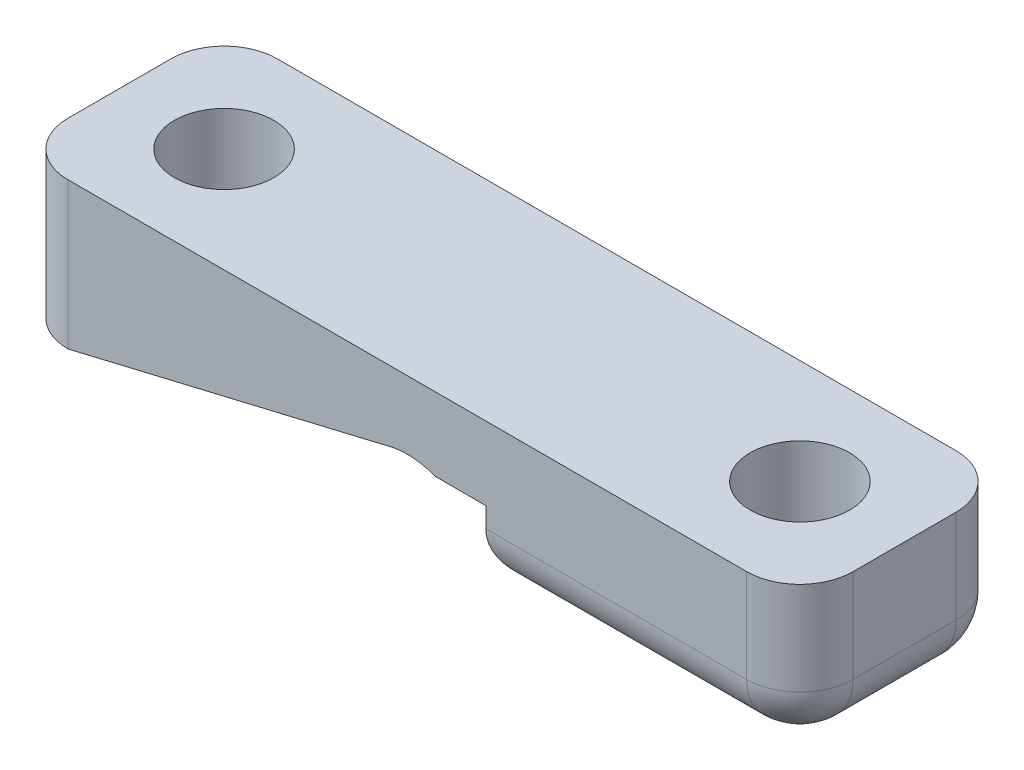
ISO-10303-21;
HEADER;
FILE_DESCRIPTION(('STEP AP214'),'2;1');
FILE_NAME('part.step','',(''),(''),'','','');
FILE_SCHEMA(('AUTOMOTIVE_DESIGN { 1 0 10303 214 1 1 1 1 }'));
ENDSEC;
DATA;
#1=APPLICATION_CONTEXT('core data for automotive mechanical design processes');
#2=APPLICATION_PROTOCOL_DEFINITION('international standard','automotive_design',2000,#1);
#3=PRODUCT_CONTEXT('',#1,'mechanical');
#4=PRODUCT('Part','Part','',(#3));
#5=PRODUCT_RELATED_PRODUCT_CATEGORY('part','',(#4));
#6=PRODUCT_DEFINITION_FORMATION('','',#4);
#7=PRODUCT_DEFINITION_CONTEXT('part definition',#1,'design');
#8=PRODUCT_DEFINITION('design','',#6,#7);
#9=PRODUCT_DEFINITION_SHAPE('','',#8);
#10=(LENGTH_UNIT() NAMED_UNIT(*) SI_UNIT(.MILLI.,.METRE.));
#11=(NAMED_UNIT(*) PLANE_ANGLE_UNIT() SI_UNIT($,.RADIAN.));
#12=(NAMED_UNIT(*) SI_UNIT($,.STERADIAN.) SOLID_ANGLE_UNIT());
#13=UNCERTAINTY_MEASURE_WITH_UNIT(LENGTH_MEASURE(1.E-05),#10,'distance_accuracy_value','');
#14=(GEOMETRIC_REPRESENTATION_CONTEXT(3) GLOBAL_UNCERTAINTY_ASSIGNED_CONTEXT((#13)) GLOBAL_UNIT_ASSIGNED_CONTEXT((#10,
#11,#12)) REPRESENTATION_CONTEXT('',''));
#15=CARTESIAN_POINT('',(0.,0.,0.));
#16=DIRECTION('',(0.,0.,1.));
#17=DIRECTION('',(1.,0.,0.));
#18=AXIS2_PLACEMENT_3D('',#15,#16,#17);
#19=CARTESIAN_POINT('',(0.,0.,10.));
#20=DIRECTION('',(0.,1.,0.));
#21=DIRECTION('',(0.,0.,1.));
#22=AXIS2_PLACEMENT_3D('',#19,#20,#21);
#23=PLANE('',#22);
#24=DIRECTION('',(0.,0.,-1.));
#25=VECTOR('',#24,1.);
#26=CARTESIAN_POINT('',(34.96,0.,10.));
#27=LINE('',#26,#25);
#28=CARTESIAN_POINT('',(34.96,0.,2.54));
#29=VERTEX_POINT('',#28);
#30=CARTESIAN_POINT('',(34.96,0.,7.46));
#31=VERTEX_POINT('',#30);
#32=EDGE_CURVE('E300',#29,#31,#27,.F.);
#33=ORIENTED_EDGE('',*,*,#32,.T.);
#34=DIRECTION('',(1.,0.,0.));
#35=VECTOR('',#34,1.);
#36=CARTESIAN_POINT('',(0.,0.,7.46));
#37=LINE('',#36,#35);
#38=CARTESIAN_POINT('',(24.9584866892291,0.,7.46));
#39=VERTEX_POINT('',#38);
#40=EDGE_CURVE('E303',#31,#39,#37,.F.);
#41=ORIENTED_EDGE('',*,*,#40,.T.);
#42=CARTESIAN_POINT('',(30.7341258248556,0.,8.39004140497769));
#43=DIRECTION('',(0.,1.,0.));
#44=DIRECTION('',(0.,0.,1.));
#45=AXIS2_PLACEMENT_3D('',#42,#43,#44);
#46=CIRCLE('',#45,5.85004140497769);
#47=CARTESIAN_POINT('',(30.7341258248556,0.,2.54));
#48=VERTEX_POINT('',#47);
#49=EDGE_CURVE('E294',#39,#48,#46,.F.);
#50=ORIENTED_EDGE('',*,*,#49,.T.);
#51=DIRECTION('',(1.,0.,0.));
#52=VECTOR('',#51,1.);
#53=CARTESIAN_POINT('',(34.96,0.,2.54));
#54=LINE('',#53,#52);
#55=EDGE_CURVE('E297',#48,#29,#54,.T.);
#56=ORIENTED_EDGE('',*,*,#55,.T.);
#57=EDGE_LOOP('',(#33,#41,#50,#56));
#58=FACE_BOUND('',#57,.T.);
#59=CARTESIAN_POINT('',(32.5,0.,5.));
#60=DIRECTION('',(0.,1.,0.));
#61=DIRECTION('',(0.,0.,1.));
#62=AXIS2_PLACEMENT_3D('',#59,#60,#61);
#63=CIRCLE('',#62,2.375);
#64=CARTESIAN_POINT('',(32.5,0.,7.375));
#65=VERTEX_POINT('',#64);
#66=EDGE_CURVE('E206',#65,#65,#63,.T.);
#67=ORIENTED_EDGE('',*,*,#66,.T.);
#68=EDGE_LOOP('',(#67));
#69=FACE_BOUND('',#68,.T.);
#70=ADVANCED_FACE('F41',(#58,#69),#23,.F.);
#71=CARTESIAN_POINT('',(0.,0.,10.));
#72=DIRECTION('',(0.,0.,-1.));
#73=DIRECTION('',(-1.,0.,0.));
#74=AXIS2_PLACEMENT_3D('',#71,#72,#73);
#75=PLANE('',#74);
#76=DIRECTION('',(0.,-1.,0.));
#77=VECTOR('',#76,1.);
#78=CARTESIAN_POINT('',(22.5,3.5,10.));
#79=LINE('',#78,#77);
#80=CARTESIAN_POINT('',(22.5,3.5,10.));
#81=VERTEX_POINT('',#80);
#82=CARTESIAN_POINT('',(22.5,2.54,10.));
#83=VERTEX_POINT('',#82);
#84=EDGE_CURVE('E146',#81,#83,#79,.T.);
#85=ORIENTED_EDGE('',*,*,#84,.T.);
#86=DIRECTION('',(1.,0.,0.));
#87=VECTOR('',#86,1.);
#88=CARTESIAN_POINT('',(0.,2.54,10.));
#89=LINE('',#88,#87);
#90=CARTESIAN_POINT('',(34.96,2.54,10.));
#91=VERTEX_POINT('',#90);
#92=EDGE_CURVE('E291',#83,#91,#89,.T.);
#93=ORIENTED_EDGE('',*,*,#92,.T.);
#94=DIRECTION('',(0.,1.,0.));
#95=VECTOR('',#94,1.);
#96=CARTESIAN_POINT('',(34.96,0.,10.));
#97=LINE('',#96,#95);
#98=CARTESIAN_POINT('',(34.96,7.,10.));
#99=VERTEX_POINT('',#98);
#100=EDGE_CURVE('E273',#91,#99,#97,.T.);
#101=ORIENTED_EDGE('',*,*,#100,.T.);
#102=DIRECTION('',(-1.,0.,0.));
#103=VECTOR('',#102,1.);
#104=CARTESIAN_POINT('',(0.,7.,10.));
#105=LINE('',#104,#103);
#106=CARTESIAN_POINT('',(2.54,7.,10.));
#107=VERTEX_POINT('',#106);
#108=EDGE_CURVE('E216',#99,#107,#105,.T.);
#109=ORIENTED_EDGE('',*,*,#108,.T.);
#110=DIRECTION('',(0.,-1.,0.));
#111=VECTOR('',#110,1.);
#112=CARTESIAN_POINT('',(2.54,0.,10.));
#113=LINE('',#112,#111);
#114=CARTESIAN_POINT('',(2.54,0.,10.));
#115=VERTEX_POINT('',#114);
#116=EDGE_CURVE('E269',#107,#115,#113,.T.);
#117=ORIENTED_EDGE('',*,*,#116,.T.);
#118=DIRECTION('',(0.972969168958049,0.230935047701912,0.));
#119=VECTOR('',#118,1.);
#120=CARTESIAN_POINT('',(2.54,0.,10.));
#121=LINE('',#120,#119);
#122=CARTESIAN_POINT('',(17.6700654329473,3.59113371108409,10.));
#123=VERTEX_POINT('',#122);
#124=EDGE_CURVE('E178',#115,#123,#121,.T.);
#125=ORIENTED_EDGE('',*,*,#124,.T.);
#126=CARTESIAN_POINT('',(18.75,0.,10.));
#127=DIRECTION('',(0.,0.,-1.));
#128=DIRECTION('',(-1.,0.,0.));
#129=AXIS2_PLACEMENT_3D('',#126,#127,#128);
#130=CIRCLE('',#129,3.75);
#131=CARTESIAN_POINT('',(20.0962912017836,3.5,10.));
#132=VERTEX_POINT('',#131);
#133=EDGE_CURVE('E170',#123,#132,#130,.T.);
#134=ORIENTED_EDGE('',*,*,#133,.T.);
#135=DIRECTION('',(-1.,0.,0.));
#136=VECTOR('',#135,1.);
#137=CARTESIAN_POINT('',(0.,3.5,10.));
#138=LINE('',#137,#136);
#139=EDGE_CURVE('E161',#81,#132,#138,.T.);
#140=ORIENTED_EDGE('',*,*,#139,.F.);
#141=EDGE_LOOP('',(#85,#93,#101,#109,#117,#125,#134,#140));
#142=FACE_BOUND('',#141,.T.);
#143=ADVANCED_FACE('F167',(#142),#75,.F.);
#144=CARTESIAN_POINT('',(18.75,0.,0.));
#145=DIRECTION('',(0.,0.,1.));
#146=DIRECTION('',(1.,0.,0.));
#147=AXIS2_PLACEMENT_3D('',#144,#145,#146);
#148=CYLINDRICAL_SURFACE('',#147,3.75);
#149=DIRECTION('',(0.,0.,1.));
#150=VECTOR('',#149,1.);
#151=CARTESIAN_POINT('',(20.0962912017836,3.5,0.));
#152=LINE('',#151,#150);
#153=CARTESIAN_POINT('',(20.0962912017836,3.5,0.));
#154=VERTEX_POINT('',#153);
#155=EDGE_CURVE('E276',#132,#154,#152,.F.);
#156=ORIENTED_EDGE('',*,*,#155,.F.);
#157=ORIENTED_EDGE('',*,*,#133,.F.);
#158=DIRECTION('',(0.,0.,1.));
#159=VECTOR('',#158,1.);
#160=CARTESIAN_POINT('',(17.6700654329473,3.59113371108409,0.));
#161=LINE('',#160,#159);
#162=CARTESIAN_POINT('',(17.6700654329473,3.59113371108409,0.));
#163=VERTEX_POINT('',#162);
#164=EDGE_CURVE('E188',#123,#163,#161,.F.);
#165=ORIENTED_EDGE('',*,*,#164,.T.);
#166=CARTESIAN_POINT('',(18.75,0.,0.));
#167=DIRECTION('',(0.,0.,1.));
#168=DIRECTION('',(1.,0.,0.));
#169=AXIS2_PLACEMENT_3D('',#166,#167,#168);
#170=CIRCLE('',#169,3.75);
#171=EDGE_CURVE('E210',#154,#163,#170,.T.);
#172=ORIENTED_EDGE('',*,*,#171,.F.);
#173=EDGE_LOOP('',(#156,#157,#165,#172));
#174=FACE_BOUND('',#173,.T.);
#175=ADVANCED_FACE('F361',(#174),#148,.F.);
#176=CARTESIAN_POINT('',(2.54,0.,2.54));
#177=DIRECTION('',(0.,1.,0.));
#178=DIRECTION('',(0.,0.,1.));
#179=AXIS2_PLACEMENT_3D('',#176,#177,#178);
#180=CIRCLE('',#179,2.54);
#181=CARTESIAN_POINT('',(0.,0.,2.54));
#182=VERTEX_POINT('',#181);
#183=CARTESIAN_POINT('',(2.54,0.,0.));
#184=VERTEX_POINT('',#183);
#185=EDGE_CURVE('E245',#182,#184,#180,.F.);
#186=ORIENTED_EDGE('',*,*,#185,.T.);
#187=DIRECTION('',(0.,0.,-1.));
#188=VECTOR('',#187,1.);
#189=CARTESIAN_POINT('',(2.54,0.,10.));
#190=LINE('',#189,#188);
#191=EDGE_CURVE('E182',#115,#184,#190,.T.);
#192=ORIENTED_EDGE('',*,*,#191,.F.);
#193=CARTESIAN_POINT('',(2.54,0.,7.46));
#194=DIRECTION('',(0.,1.,0.));
#195=DIRECTION('',(0.,0.,1.));
#196=AXIS2_PLACEMENT_3D('',#193,#194,#195);
#197=CIRCLE('',#196,2.54);
#198=CARTESIAN_POINT('',(0.,0.,7.46));
#199=VERTEX_POINT('',#198);
#200=EDGE_CURVE('E242',#115,#199,#197,.F.);
#201=ORIENTED_EDGE('',*,*,#200,.T.);
#202=DIRECTION('',(0.,0.,-1.));
#203=VECTOR('',#202,1.);
#204=CARTESIAN_POINT('',(0.,0.,10.));
#205=LINE('',#204,#203);
#206=EDGE_CURVE('E231',#199,#182,#205,.T.);
#207=ORIENTED_EDGE('',*,*,#206,.T.);
#208=EDGE_LOOP('',(#186,#192,#201,#207));
#209=FACE_BOUND('',#208,.T.);
#210=ADVANCED_FACE('F357',(#209),#23,.F.);
#211=CARTESIAN_POINT('',(0.,0.,10.));
#212=DIRECTION('',(1.,0.,0.));
#213=DIRECTION('',(0.,0.,-1.));
#214=AXIS2_PLACEMENT_3D('',#211,#212,#213);
#215=PLANE('',#214);
#216=DIRECTION('',(0.,0.,-1.));
#217=VECTOR('',#216,1.);
#218=CARTESIAN_POINT('',(0.,7.,10.));
#219=LINE('',#218,#217);
#220=CARTESIAN_POINT('',(0.,7.,7.46));
#221=VERTEX_POINT('',#220);
#222=CARTESIAN_POINT('',(0.,7.,2.54));
#223=VERTEX_POINT('',#222);
#224=EDGE_CURVE('E220',#221,#223,#219,.T.);
#225=ORIENTED_EDGE('',*,*,#224,.T.);
#226=DIRECTION('',(0.,-1.,0.));
#227=VECTOR('',#226,1.);
#228=CARTESIAN_POINT('',(0.,0.,2.54));
#229=LINE('',#228,#227);
#230=EDGE_CURVE('E238',#223,#182,#229,.T.);
#231=ORIENTED_EDGE('',*,*,#230,.T.);
#232=ORIENTED_EDGE('',*,*,#206,.F.);
#233=DIRECTION('',(0.,-1.,0.));
#234=VECTOR('',#233,1.);
#235=CARTESIAN_POINT('',(0.,0.,7.46));
#236=LINE('',#235,#234);
#237=EDGE_CURVE('E235',#199,#221,#236,.F.);
#238=ORIENTED_EDGE('',*,*,#237,.T.);
#239=EDGE_LOOP('',(#225,#231,#232,#238));
#240=FACE_BOUND('',#239,.T.);
#241=ADVANCED_FACE('F367',(#240),#215,.F.);
#242=CARTESIAN_POINT('',(37.5,0.,10.));
#243=DIRECTION('',(-1.,0.,0.));
#244=DIRECTION('',(0.,0.,1.));
#245=AXIS2_PLACEMENT_3D('',#242,#243,#244);
#246=PLANE('',#245);
#247=DIRECTION('',(0.,1.,0.));
#248=VECTOR('',#247,1.);
#249=CARTESIAN_POINT('',(37.5,0.,7.46));
#250=LINE('',#249,#248);
#251=CARTESIAN_POINT('',(37.5,7.,7.46));
#252=VERTEX_POINT('',#251);
#253=CARTESIAN_POINT('',(37.5,2.54,7.46));
#254=VERTEX_POINT('',#253);
#255=EDGE_CURVE('E262',#252,#254,#250,.F.);
#256=ORIENTED_EDGE('',*,*,#255,.T.);
#257=DIRECTION('',(0.,0.,-1.));
#258=VECTOR('',#257,1.);
#259=CARTESIAN_POINT('',(37.5,2.54,10.));
#260=LINE('',#259,#258);
#261=CARTESIAN_POINT('',(37.5,2.54,2.54));
#262=VERTEX_POINT('',#261);
#263=EDGE_CURVE('E310',#254,#262,#260,.T.);
#264=ORIENTED_EDGE('',*,*,#263,.T.);
#265=DIRECTION('',(0.,1.,0.));
#266=VECTOR('',#265,1.);
#267=CARTESIAN_POINT('',(37.5,7.,2.54));
#268=LINE('',#267,#266);
#269=CARTESIAN_POINT('',(37.5,7.,2.54));
#270=VERTEX_POINT('',#269);
#271=EDGE_CURVE('E266',#262,#270,#268,.T.);
#272=ORIENTED_EDGE('',*,*,#271,.T.);
#273=DIRECTION('',(0.,0.,-1.));
#274=VECTOR('',#273,1.);
#275=CARTESIAN_POINT('',(37.5,7.,10.));
#276=LINE('',#275,#274);
#277=EDGE_CURVE('E227',#252,#270,#276,.T.);
#278=ORIENTED_EDGE('',*,*,#277,.F.);
#279=EDGE_LOOP('',(#256,#264,#272,#278));
#280=FACE_BOUND('',#279,.T.);
#281=ADVANCED_FACE('F373',(#280),#246,.F.);
#282=CARTESIAN_POINT('',(0.,7.,10.));
#283=DIRECTION('',(0.,-1.,0.));
#284=DIRECTION('',(0.,0.,-1.));
#285=AXIS2_PLACEMENT_3D('',#282,#283,#284);
#286=PLANE('',#285);
#287=CARTESIAN_POINT('',(5.,7.,5.));
#288=DIRECTION('',(0.,1.,0.));
#289=DIRECTION('',(0.,0.,1.));
#290=AXIS2_PLACEMENT_3D('',#287,#288,#289);
#291=CIRCLE('',#290,2.375);
#292=CARTESIAN_POINT('',(5.,7.,7.375));
#293=VERTEX_POINT('',#292);
#294=EDGE_CURVE('E196',#293,#293,#291,.T.);
#295=ORIENTED_EDGE('',*,*,#294,.F.);
#296=EDGE_LOOP('',(#295));
#297=FACE_BOUND('',#296,.T.);
#298=CARTESIAN_POINT('',(32.5,7.,5.));
#299=DIRECTION('',(0.,1.,0.));
#300=DIRECTION('',(0.,0.,1.));
#301=AXIS2_PLACEMENT_3D('',#298,#299,#300);
#302=CIRCLE('',#301,2.375);
#303=CARTESIAN_POINT('',(32.5,7.,7.375));
#304=VERTEX_POINT('',#303);
#305=EDGE_CURVE('E202',#304,#304,#302,.T.);
#306=ORIENTED_EDGE('',*,*,#305,.F.);
#307=EDGE_LOOP('',(#306));
#308=FACE_BOUND('',#307,.T.);
#309=DIRECTION('',(-1.,0.,0.));
#310=VECTOR('',#309,1.);
#311=CARTESIAN_POINT('',(0.,7.,0.));
#312=LINE('',#311,#310);
#313=CARTESIAN_POINT('',(34.96,7.,0.));
#314=VERTEX_POINT('',#313);
#315=CARTESIAN_POINT('',(2.54,7.,0.));
#316=VERTEX_POINT('',#315);
#317=EDGE_CURVE('E215',#314,#316,#312,.T.);
#318=ORIENTED_EDGE('',*,*,#317,.T.);
#319=CARTESIAN_POINT('',(2.54,7.,2.54));
#320=DIRECTION('',(0.,-1.,0.));
#321=DIRECTION('',(0.,0.,-1.));
#322=AXIS2_PLACEMENT_3D('',#319,#320,#321);
#323=CIRCLE('',#322,2.54);
#324=EDGE_CURVE('E259',#316,#223,#323,.F.);
#325=ORIENTED_EDGE('',*,*,#324,.T.);
#326=ORIENTED_EDGE('',*,*,#224,.F.);
#327=CARTESIAN_POINT('',(2.54,7.,7.46));
#328=DIRECTION('',(0.,-1.,0.));
#329=DIRECTION('',(0.,0.,-1.));
#330=AXIS2_PLACEMENT_3D('',#327,#328,#329);
#331=CIRCLE('',#330,2.54);
#332=EDGE_CURVE('E250',#221,#107,#331,.F.);
#333=ORIENTED_EDGE('',*,*,#332,.T.);
#334=ORIENTED_EDGE('',*,*,#108,.F.);
#335=CARTESIAN_POINT('',(34.96,7.,7.46));
#336=DIRECTION('',(0.,-1.,0.));
#337=DIRECTION('',(0.,0.,-1.));
#338=AXIS2_PLACEMENT_3D('',#335,#336,#337);
#339=CIRCLE('',#338,2.54);
#340=EDGE_CURVE('E253',#99,#252,#339,.F.);
#341=ORIENTED_EDGE('',*,*,#340,.T.);
#342=ORIENTED_EDGE('',*,*,#277,.T.);
#343=CARTESIAN_POINT('',(34.96,7.,2.54));
#344=DIRECTION('',(0.,-1.,0.));
#345=DIRECTION('',(0.,0.,-1.));
#346=AXIS2_PLACEMENT_3D('',#343,#344,#345);
#347=CIRCLE('',#346,2.54);
#348=EDGE_CURVE('E256',#270,#314,#347,.F.);
#349=ORIENTED_EDGE('',*,*,#348,.T.);
#350=EDGE_LOOP('',(#318,#325,#326,#333,#334,#341,#342,#349));
#351=FACE_BOUND('',#350,.T.);
#352=ADVANCED_FACE('F389',(#297,#308,#351),#286,.F.);
#353=CARTESIAN_POINT('',(0.,0.,0.));
#354=DIRECTION('',(0.,0.,-1.));
#355=DIRECTION('',(-1.,0.,0.));
#356=AXIS2_PLACEMENT_3D('',#353,#354,#355);
#357=PLANE('',#356);
#358=DIRECTION('',(0.,1.,0.));
#359=VECTOR('',#358,1.);
#360=CARTESIAN_POINT('',(34.96,0.,0.));
#361=LINE('',#360,#359);
#362=CARTESIAN_POINT('',(34.96,2.54,0.));
#363=VERTEX_POINT('',#362);
#364=EDGE_CURVE('E246',#314,#363,#361,.F.);
#365=ORIENTED_EDGE('',*,*,#364,.T.);
#366=DIRECTION('',(1.,0.,0.));
#367=VECTOR('',#366,1.);
#368=CARTESIAN_POINT('',(30.7341258248556,2.54,0.));
#369=LINE('',#368,#367);
#370=CARTESIAN_POINT('',(30.7341258248556,2.54,0.));
#371=VERTEX_POINT('',#370);
#372=EDGE_CURVE('E51',#363,#371,#369,.F.);
#373=ORIENTED_EDGE('',*,*,#372,.T.);
#374=DIRECTION('',(0.,-1.,0.));
#375=VECTOR('',#374,1.);
#376=CARTESIAN_POINT('',(30.7341258248556,3.5,0.));
#377=LINE('',#376,#375);
#378=CARTESIAN_POINT('',(30.7341258248556,3.5,0.));
#379=VERTEX_POINT('',#378);
#380=EDGE_CURVE('E156',#379,#371,#377,.T.);
#381=ORIENTED_EDGE('',*,*,#380,.F.);
#382=DIRECTION('',(1.,0.,0.));
#383=VECTOR('',#382,1.);
#384=CARTESIAN_POINT('',(0.,3.5,0.));
#385=LINE('',#384,#383);
#386=EDGE_CURVE('E157',#154,#379,#385,.T.);
#387=ORIENTED_EDGE('',*,*,#386,.F.);
#388=ORIENTED_EDGE('',*,*,#171,.T.);
#389=DIRECTION('',(0.972969168958049,0.230935047701912,0.));
#390=VECTOR('',#389,1.);
#391=CARTESIAN_POINT('',(0.135460730492994,-0.570719410872374,0.));
#392=LINE('',#391,#390);
#393=EDGE_CURVE('E192',#184,#163,#392,.T.);
#394=ORIENTED_EDGE('',*,*,#393,.F.);
#395=DIRECTION('',(0.,-1.,0.));
#396=VECTOR('',#395,1.);
#397=CARTESIAN_POINT('',(2.54,7.,0.));
#398=LINE('',#397,#396);
#399=EDGE_CURVE('E249',#184,#316,#398,.F.);
#400=ORIENTED_EDGE('',*,*,#399,.T.);
#401=ORIENTED_EDGE('',*,*,#317,.F.);
#402=EDGE_LOOP('',(#365,#373,#381,#387,#388,#394,#400,#401));
#403=FACE_BOUND('',#402,.T.);
#404=ADVANCED_FACE('F387',(#403),#357,.T.);
#405=CARTESIAN_POINT('',(2.54,0.,2.54));
#406=DIRECTION('',(0.,1.,0.));
#407=DIRECTION('',(0.,0.,1.));
#408=AXIS2_PLACEMENT_3D('',#405,#406,#407);
#409=CYLINDRICAL_SURFACE('',#408,2.54);
#410=ORIENTED_EDGE('',*,*,#324,.F.);
#411=ORIENTED_EDGE('',*,*,#399,.F.);
#412=ORIENTED_EDGE('',*,*,#185,.F.);
#413=ORIENTED_EDGE('',*,*,#230,.F.);
#414=EDGE_LOOP('',(#410,#411,#412,#413));
#415=FACE_BOUND('',#414,.T.);
#416=ADVANCED_FACE('F384',(#415),#409,.T.);
#417=CARTESIAN_POINT('',(34.96,0.,2.54));
#418=DIRECTION('',(0.,-1.,0.));
#419=DIRECTION('',(0.,0.,-1.));
#420=AXIS2_PLACEMENT_3D('',#417,#418,#419);
#421=CYLINDRICAL_SURFACE('',#420,2.54);
#422=ORIENTED_EDGE('',*,*,#271,.F.);
#423=CARTESIAN_POINT('',(34.96,2.54,2.54));
#424=DIRECTION('',(0.,-1.,0.));
#425=DIRECTION('',(0.,0.,-1.));
#426=AXIS2_PLACEMENT_3D('',#423,#424,#425);
#427=CIRCLE('',#426,2.54);
#428=EDGE_CURVE('E66',#262,#363,#427,.F.);
#429=ORIENTED_EDGE('',*,*,#428,.T.);
#430=ORIENTED_EDGE('',*,*,#364,.F.);
#431=ORIENTED_EDGE('',*,*,#348,.F.);
#432=EDGE_LOOP('',(#422,#429,#430,#431));
#433=FACE_BOUND('',#432,.T.);
#434=ADVANCED_FACE('F393',(#433),#421,.T.);
#435=CARTESIAN_POINT('',(34.96,0.,7.46));
#436=DIRECTION('',(0.,1.,0.));
#437=DIRECTION('',(0.,0.,1.));
#438=AXIS2_PLACEMENT_3D('',#435,#436,#437);
#439=CYLINDRICAL_SURFACE('',#438,2.54);
#440=ORIENTED_EDGE('',*,*,#100,.F.);
#441=CARTESIAN_POINT('',(34.96,2.54,7.46));
#442=DIRECTION('',(0.,1.,0.));
#443=DIRECTION('',(0.,0.,1.));
#444=AXIS2_PLACEMENT_3D('',#441,#442,#443);
#445=CIRCLE('',#444,2.54);
#446=EDGE_CURVE('E307',#91,#254,#445,.T.);
#447=ORIENTED_EDGE('',*,*,#446,.T.);
#448=ORIENTED_EDGE('',*,*,#255,.F.);
#449=ORIENTED_EDGE('',*,*,#340,.F.);
#450=EDGE_LOOP('',(#440,#447,#448,#449));
#451=FACE_BOUND('',#450,.T.);
#452=ADVANCED_FACE('F414',(#451),#439,.T.);
#453=CARTESIAN_POINT('',(2.54,0.,7.46));
#454=DIRECTION('',(0.,-1.,0.));
#455=DIRECTION('',(0.,0.,-1.));
#456=AXIS2_PLACEMENT_3D('',#453,#454,#455);
#457=CYLINDRICAL_SURFACE('',#456,2.54);
#458=ORIENTED_EDGE('',*,*,#332,.F.);
#459=ORIENTED_EDGE('',*,*,#237,.F.);
#460=ORIENTED_EDGE('',*,*,#200,.F.);
#461=ORIENTED_EDGE('',*,*,#116,.F.);
#462=EDGE_LOOP('',(#458,#459,#460,#461));
#463=FACE_BOUND('',#462,.T.);
#464=ADVANCED_FACE('F420',(#463),#457,.T.);
#465=CARTESIAN_POINT('',(32.5,7.,5.));
#466=DIRECTION('',(0.,1.,0.));
#467=DIRECTION('',(0.,0.,1.));
#468=AXIS2_PLACEMENT_3D('',#465,#466,#467);
#469=CYLINDRICAL_SURFACE('',#468,2.375);
#470=ORIENTED_EDGE('',*,*,#66,.F.);
#471=EDGE_LOOP('',(#470));
#472=FACE_BOUND('',#471,.T.);
#473=ORIENTED_EDGE('',*,*,#305,.T.);
#474=EDGE_LOOP('',(#473));
#475=FACE_BOUND('',#474,.T.);
#476=ADVANCED_FACE('F423',(#472,#475),#469,.F.);
#477=CARTESIAN_POINT('',(5.,7.,5.));
#478=DIRECTION('',(0.,1.,0.));
#479=DIRECTION('',(0.,0.,1.));
#480=AXIS2_PLACEMENT_3D('',#477,#478,#479);
#481=CYLINDRICAL_SURFACE('',#480,2.375);
#482=CARTESIAN_POINT('',(5.,0.583883061736767,5.));
#483=DIRECTION('',(-0.230935047701912,0.972969168958049,0.));
#484=DIRECTION('',(0.972969168958049,0.230935047701912,0.));
#485=AXIS2_PLACEMENT_3D('',#482,#483,#484);
#486=ELLIPSE('',#485,2.44098176568471,2.375);
#487=CARTESIAN_POINT('',(7.375,1.14759130223466,5.));
#488=VERTEX_POINT('',#487);
#489=EDGE_CURVE('E185',#488,#488,#486,.F.);
#490=ORIENTED_EDGE('',*,*,#489,.T.);
#491=EDGE_LOOP('',(#490));
#492=FACE_BOUND('',#491,.T.);
#493=ORIENTED_EDGE('',*,*,#294,.T.);
#494=EDGE_LOOP('',(#493));
#495=FACE_BOUND('',#494,.T.);
#496=ADVANCED_FACE('F428',(#492,#495),#481,.F.);
#497=CARTESIAN_POINT('',(2.54,0.,10.));
#498=DIRECTION('',(-0.230935047701912,0.972969168958049,0.));
#499=DIRECTION('',(-0.972969168958049,-0.230935047701912,0.));
#500=AXIS2_PLACEMENT_3D('',#497,#498,#499);
#501=PLANE('',#500);
#502=ORIENTED_EDGE('',*,*,#393,.T.);
#503=ORIENTED_EDGE('',*,*,#164,.F.);
#504=ORIENTED_EDGE('',*,*,#124,.F.);
#505=ORIENTED_EDGE('',*,*,#191,.T.);
#506=EDGE_LOOP('',(#502,#503,#504,#505));
#507=FACE_BOUND('',#506,.T.);
#508=ORIENTED_EDGE('',*,*,#489,.F.);
#509=EDGE_LOOP('',(#508));
#510=FACE_BOUND('',#509,.T.);
#511=ADVANCED_FACE('F505',(#507,#510),#501,.F.);
#512=CARTESIAN_POINT('',(30.7341258248556,3.5,8.39004140497769));
#513=DIRECTION('',(0.,-1.,0.));
#514=DIRECTION('',(0.,0.,-1.));
#515=AXIS2_PLACEMENT_3D('',#512,#513,#514);
#516=CYLINDRICAL_SURFACE('',#515,8.39004140497769);
#517=ORIENTED_EDGE('',*,*,#380,.T.);
#518=CARTESIAN_POINT('',(30.7341258248556,2.54,8.39004140497769));
#519=DIRECTION('',(0.,1.,0.));
#520=DIRECTION('',(0.,0.,1.));
#521=AXIS2_PLACEMENT_3D('',#518,#519,#520);
#522=CIRCLE('',#521,8.39004140497769);
#523=EDGE_CURVE('E11',#371,#83,#522,.T.);
#524=ORIENTED_EDGE('',*,*,#523,.T.);
#525=ORIENTED_EDGE('',*,*,#84,.F.);
#526=CARTESIAN_POINT('',(30.7341258248556,3.5,8.39004140497769));
#527=DIRECTION('',(0.,-1.,0.));
#528=DIRECTION('',(0.,0.,-1.));
#529=AXIS2_PLACEMENT_3D('',#526,#527,#528);
#530=CIRCLE('',#529,8.39004140497769);
#531=EDGE_CURVE('E149',#81,#379,#530,.T.);
#532=ORIENTED_EDGE('',*,*,#531,.T.);
#533=EDGE_LOOP('',(#517,#524,#525,#532));
#534=FACE_BOUND('',#533,.T.);
#535=ADVANCED_FACE('F148',(#534),#516,.T.);
#536=CARTESIAN_POINT('',(0.,3.5,0.));
#537=DIRECTION('',(0.,-1.,0.));
#538=DIRECTION('',(0.,0.,-1.));
#539=AXIS2_PLACEMENT_3D('',#536,#537,#538);
#540=PLANE('',#539);
#541=ORIENTED_EDGE('',*,*,#155,.T.);
#542=ORIENTED_EDGE('',*,*,#386,.T.);
#543=ORIENTED_EDGE('',*,*,#531,.F.);
#544=ORIENTED_EDGE('',*,*,#139,.T.);
#545=EDGE_LOOP('',(#541,#542,#543,#544));
#546=FACE_BOUND('',#545,.T.);
#547=ADVANCED_FACE('F160',(#546),#540,.T.);
#548=CARTESIAN_POINT('',(34.96,2.54,2.54));
#549=DIRECTION('',(0.,1.,0.));
#550=DIRECTION('',(0.,0.,1.));
#551=AXIS2_PLACEMENT_3D('',#548,#549,#550);
#552=SPHERICAL_SURFACE('',#551,2.54);
#553=CARTESIAN_POINT('',(34.96,2.54,2.54));
#554=DIRECTION('',(0.,0.,1.));
#555=DIRECTION('',(1.,0.,0.));
#556=AXIS2_PLACEMENT_3D('',#553,#554,#555);
#557=CIRCLE('',#556,2.54);
#558=EDGE_CURVE('E397',#29,#262,#557,.T.);
#559=ORIENTED_EDGE('',*,*,#558,.F.);
#560=CARTESIAN_POINT('',(34.96,2.54,2.54));
#561=DIRECTION('',(-1.,0.,0.));
#562=DIRECTION('',(0.,0.,1.));
#563=AXIS2_PLACEMENT_3D('',#560,#561,#562);
#564=CIRCLE('',#563,2.54);
#565=EDGE_CURVE('E45',#363,#29,#564,.T.);
#566=ORIENTED_EDGE('',*,*,#565,.F.);
#567=ORIENTED_EDGE('',*,*,#428,.F.);
#568=EDGE_LOOP('',(#559,#566,#567));
#569=FACE_BOUND('',#568,.T.);
#570=ADVANCED_FACE('F43',(#569),#552,.T.);
#571=CARTESIAN_POINT('',(0.,2.54,2.54));
#572=DIRECTION('',(-1.,0.,0.));
#573=DIRECTION('',(0.,0.,1.));
#574=AXIS2_PLACEMENT_3D('',#571,#572,#573);
#575=CYLINDRICAL_SURFACE('',#574,2.54);
#576=ORIENTED_EDGE('',*,*,#565,.T.);
#577=ORIENTED_EDGE('',*,*,#55,.F.);
#578=CARTESIAN_POINT('',(30.7341258248556,2.54,2.54));
#579=DIRECTION('',(-1.,0.,0.));
#580=DIRECTION('',(0.,0.,1.));
#581=AXIS2_PLACEMENT_3D('',#578,#579,#580);
#582=CIRCLE('',#581,2.54);
#583=EDGE_CURVE('E403',#371,#48,#582,.T.);
#584=ORIENTED_EDGE('',*,*,#583,.F.);
#585=ORIENTED_EDGE('',*,*,#372,.F.);
#586=EDGE_LOOP('',(#576,#577,#584,#585));
#587=FACE_BOUND('',#586,.T.);
#588=ADVANCED_FACE('F345',(#587),#575,.T.);
#589=CARTESIAN_POINT('',(34.96,2.54,10.));
#590=DIRECTION('',(0.,0.,-1.));
#591=DIRECTION('',(-1.,0.,0.));
#592=AXIS2_PLACEMENT_3D('',#589,#590,#591);
#593=CYLINDRICAL_SURFACE('',#592,2.54);
#594=ORIENTED_EDGE('',*,*,#558,.T.);
#595=ORIENTED_EDGE('',*,*,#263,.F.);
#596=CARTESIAN_POINT('',(34.96,2.54,7.46));
#597=DIRECTION('',(0.,0.,1.));
#598=DIRECTION('',(1.,0.,0.));
#599=AXIS2_PLACEMENT_3D('',#596,#597,#598);
#600=CIRCLE('',#599,2.54);
#601=EDGE_CURVE('E329',#31,#254,#600,.T.);
#602=ORIENTED_EDGE('',*,*,#601,.F.);
#603=ORIENTED_EDGE('',*,*,#32,.F.);
#604=EDGE_LOOP('',(#594,#595,#602,#603));
#605=FACE_BOUND('',#604,.T.);
#606=ADVANCED_FACE('F339',(#605),#593,.T.);
#607=CARTESIAN_POINT('',(30.7341258248556,2.54,8.39004140497769));
#608=DIRECTION('',(0.,1.,0.));
#609=DIRECTION('',(0.,0.,1.));
#610=AXIS2_PLACEMENT_3D('',#607,#608,#609);
#611=TOROIDAL_SURFACE('',#610,5.85004140497769,2.54);
#612=ORIENTED_EDGE('',*,*,#583,.T.);
#613=ORIENTED_EDGE('',*,*,#49,.F.);
#614=CARTESIAN_POINT('',(22.5,2.54,10.));
#615=CARTESIAN_POINT('',(22.4999918229937,2.48059623991372,10.0000126193907));
#616=CARTESIAN_POINT('',(22.5017156831382,2.42120010503208,9.99791643833239));
#617=CARTESIAN_POINT('',(22.5085643468927,2.30292231082814,9.98960279323589));
#618=CARTESIAN_POINT('',(22.5136875027466,2.2440404162396,9.98338732595959));
#619=CARTESIAN_POINT('',(22.5272317717626,2.12757554007945,9.96697967166332));
#620=CARTESIAN_POINT('',(22.5356333011689,2.06998695406339,9.95681110030238));
#621=CARTESIAN_POINT('',(22.5556134961025,1.95618513906931,9.93268049779097));
#622=CARTESIAN_POINT('',(22.5671923922423,1.89997201024432,9.91871819129284));
#623=CARTESIAN_POINT('',(22.6064486153732,1.73415464501897,9.87150733136996));
#624=CARTESIAN_POINT('',(22.6386802344626,1.62708076424869,9.83289230067346));
#625=CARTESIAN_POINT('',(22.7138603389547,1.42215716456752,9.74354469840207));
#626=CARTESIAN_POINT('',(22.7568219953274,1.32431898725028,9.69279723773922));
#627=CARTESIAN_POINT('',(22.8550315905832,1.13316864667939,9.57793580253726));
#628=CARTESIAN_POINT('',(22.9109006635324,1.04057451007741,9.51316333557851));
#629=CARTESIAN_POINT('',(23.0312547769123,0.868111503967784,9.37535876002597));
#630=CARTESIAN_POINT('',(23.0957430906401,0.788247494322831,9.30232351513355));
#631=CARTESIAN_POINT('',(23.2676564770722,0.602511378400629,9.11038038886175));
#632=CARTESIAN_POINT('',(23.3798264442824,0.505049579122445,8.98754745739708));
#633=CARTESIAN_POINT('',(23.6165250536696,0.337902765049049,8.73492067161078));
#634=CARTESIAN_POINT('',(23.7410852832044,0.268291140637561,8.60510943486288));
#635=CARTESIAN_POINT('',(24.0379970042121,0.137361311374143,8.30453699846374));
#636=CARTESIAN_POINT('',(24.2135023207309,0.084746100275103,8.13313694997316));
#637=CARTESIAN_POINT('',(24.5750459215852,0.0163059101158154,7.79506787751072));
#638=CARTESIAN_POINT('',(24.7610685185916,0.000427544796560048,7.62839233646935));
#639=CARTESIAN_POINT('',(24.9533392295179,2.84232989660908E-06,7.46438634161855));
#640=CARTESIAN_POINT('',(24.9559126234898,2.98960847242571E-09,7.46219272020141));
#641=CARTESIAN_POINT('',(24.9584866892291,0.,7.46));
#642=B_SPLINE_CURVE_WITH_KNOTS('',3,(#614,#615,#616,#617,#618,#619,#620,#621,#622,#623,#624,
#625,#626,#627,#628,#629,#630,#631,#632,#633,#634,#635,#636,#637,#638,#639,#640,#641),
.UNSPECIFIED.,.F.,.F.,(4,2,2,2,2,2,2,2,2,2,2,2,2,4),(0.,0.178136732873827,0.356187179747149,
0.533189913975763,0.710205498420359,1.06335796104357,1.41694606234234,1.79373131949835,
2.17066007573906,2.7458150875978,3.3224759115217,4.07155731070646,4.81954945360621,
4.82969385618867),.UNSPECIFIED.);
#643=EDGE_CURVE('E320',#83,#39,#642,.T.);
#644=ORIENTED_EDGE('',*,*,#643,.F.);
#645=ORIENTED_EDGE('',*,*,#523,.F.);
#646=EDGE_LOOP('',(#612,#613,#644,#645));
#647=FACE_BOUND('',#646,.T.);
#648=ADVANCED_FACE('F334',(#647),#611,.T.);
#649=CARTESIAN_POINT('',(34.96,2.54,7.46));
#650=DIRECTION('',(0.,1.,0.));
#651=DIRECTION('',(0.,0.,1.));
#652=AXIS2_PLACEMENT_3D('',#649,#650,#651);
#653=SPHERICAL_SURFACE('',#652,2.54);
#654=ORIENTED_EDGE('',*,*,#601,.T.);
#655=ORIENTED_EDGE('',*,*,#446,.F.);
#656=CARTESIAN_POINT('',(34.96,2.54,7.46));
#657=DIRECTION('',(-1.,0.,0.));
#658=DIRECTION('',(0.,0.,1.));
#659=AXIS2_PLACEMENT_3D('',#656,#657,#658);
#660=CIRCLE('',#659,2.54);
#661=EDGE_CURVE('E317',#31,#91,#660,.T.);
#662=ORIENTED_EDGE('',*,*,#661,.F.);
#663=EDGE_LOOP('',(#654,#655,#662));
#664=FACE_BOUND('',#663,.T.);
#665=ADVANCED_FACE('F338',(#664),#653,.T.);
#666=CARTESIAN_POINT('',(0.,2.54,7.46));
#667=DIRECTION('',(1.,0.,0.));
#668=DIRECTION('',(0.,0.,-1.));
#669=AXIS2_PLACEMENT_3D('',#666,#667,#668);
#670=CYLINDRICAL_SURFACE('',#669,2.54);
#671=ORIENTED_EDGE('',*,*,#643,.T.);
#672=ORIENTED_EDGE('',*,*,#40,.F.);
#673=ORIENTED_EDGE('',*,*,#661,.T.);
#674=ORIENTED_EDGE('',*,*,#92,.F.);
#675=EDGE_LOOP('',(#671,#672,#673,#674));
#676=FACE_BOUND('',#675,.T.);
#677=ADVANCED_FACE('F331',(#676),#670,.T.);
#678=CLOSED_SHELL('',(#70,#143,#175,#210,#241,#281,#352,#404,#416,#434,#452,#464,#476,#496,#511,
#535,#547,#570,#588,#606,#648,#665,#677));
#679=MANIFOLD_SOLID_BREP('B2',#678);
#680=ADVANCED_BREP_SHAPE_REPRESENTATION('',(#18,#679),#14);
#681=SHAPE_DEFINITION_REPRESENTATION(#9,#680);
ENDSEC;
END-ISO-10303-21;
